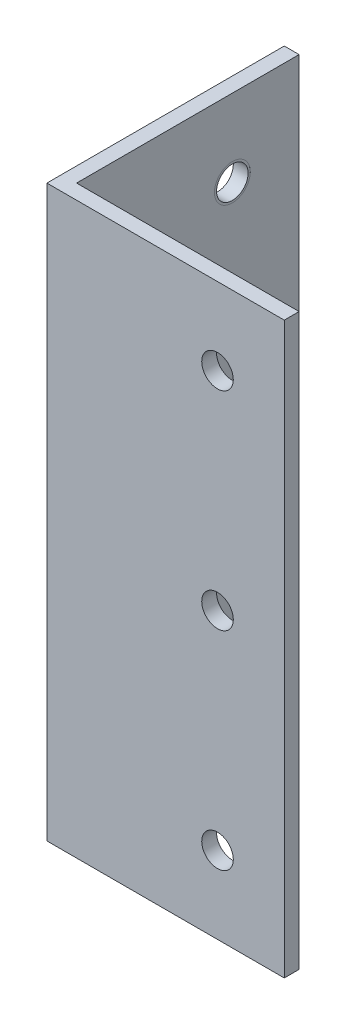
ISO-10303-21;
HEADER;
FILE_DESCRIPTION(('STEP AP214'),'2;1');
FILE_NAME('part.step','',(''),(''),'','','');
FILE_SCHEMA(('AUTOMOTIVE_DESIGN { 1 0 10303 214 1 1 1 1 }'));
ENDSEC;
DATA;
#1=APPLICATION_CONTEXT('core data for automotive mechanical design processes');
#2=APPLICATION_PROTOCOL_DEFINITION('international standard','automotive_design',2000,#1);
#3=PRODUCT_CONTEXT('',#1,'mechanical');
#4=PRODUCT('Part','Part','',(#3));
#5=PRODUCT_RELATED_PRODUCT_CATEGORY('part','',(#4));
#6=PRODUCT_DEFINITION_FORMATION('','',#4);
#7=PRODUCT_DEFINITION_CONTEXT('part definition',#1,'design');
#8=PRODUCT_DEFINITION('design','',#6,#7);
#9=PRODUCT_DEFINITION_SHAPE('','',#8);
#10=(LENGTH_UNIT() NAMED_UNIT(*) SI_UNIT(.MILLI.,.METRE.));
#11=(NAMED_UNIT(*) PLANE_ANGLE_UNIT() SI_UNIT($,.RADIAN.));
#12=(NAMED_UNIT(*) SI_UNIT($,.STERADIAN.) SOLID_ANGLE_UNIT());
#13=UNCERTAINTY_MEASURE_WITH_UNIT(LENGTH_MEASURE(1.E-05),#10,'distance_accuracy_value','');
#14=(GEOMETRIC_REPRESENTATION_CONTEXT(3) GLOBAL_UNCERTAINTY_ASSIGNED_CONTEXT((#13)) GLOBAL_UNIT_ASSIGNED_CONTEXT((#10,
#11,#12)) REPRESENTATION_CONTEXT('',''));
#15=CARTESIAN_POINT('',(0.,0.,0.));
#16=DIRECTION('',(0.,0.,1.));
#17=DIRECTION('',(1.,0.,0.));
#18=AXIS2_PLACEMENT_3D('',#15,#16,#17);
#19=CARTESIAN_POINT('',(-19.051,-34.925,-14.2875));
#20=DIRECTION('',(-1.,0.,0.));
#21=DIRECTION('',(0.,0.,1.));
#22=AXIS2_PLACEMENT_3D('',#19,#20,#21);
#23=PLANE('',#22);
#24=CARTESIAN_POINT('',(-19.051,-34.925,-14.2875));
#25=DIRECTION('',(1.,0.,0.));
#26=DIRECTION('',(0.,0.,-1.));
#27=AXIS2_PLACEMENT_3D('',#24,#25,#26);
#28=CIRCLE('',#27,3.8354);
#29=CARTESIAN_POINT('',(-19.051,-34.925,-18.1229));
#30=VERTEX_POINT('',#29);
#31=EDGE_CURVE('E150',#30,#30,#28,.T.);
#32=ORIENTED_EDGE('',*,*,#31,.T.);
#33=EDGE_LOOP('',(#32));
#34=FACE_BOUND('',#33,.T.);
#35=CARTESIAN_POINT('',(-19.051,-34.925,-14.2875));
#36=DIRECTION('',(1.,0.,0.));
#37=DIRECTION('',(0.,0.,-1.));
#38=AXIS2_PLACEMENT_3D('',#35,#36,#37);
#39=CIRCLE('',#38,3.3782);
#40=CARTESIAN_POINT('',(-19.051,-34.925,-17.6657));
#41=VERTEX_POINT('',#40);
#42=EDGE_CURVE('E465',#41,#41,#39,.T.);
#43=ORIENTED_EDGE('',*,*,#42,.F.);
#44=EDGE_LOOP('',(#43));
#45=FACE_BOUND('',#44,.T.);
#46=ADVANCED_FACE('F32',(#34,#45),#23,.F.);
#47=CARTESIAN_POINT('',(14.2875,9.52499999999999,19.051));
#48=DIRECTION('',(0.,0.,1.));
#49=DIRECTION('',(1.,0.,0.));
#50=AXIS2_PLACEMENT_3D('',#47,#48,#49);
#51=PLANE('',#50);
#52=CARTESIAN_POINT('',(14.2875,9.52499999999999,19.051));
#53=DIRECTION('',(0.,0.,-1.));
#54=DIRECTION('',(-1.,0.,0.));
#55=AXIS2_PLACEMENT_3D('',#52,#53,#54);
#56=CIRCLE('',#55,3.8354);
#57=CARTESIAN_POINT('',(10.4521,9.52499999999999,19.051));
#58=VERTEX_POINT('',#57);
#59=EDGE_CURVE('E135',#58,#58,#56,.T.);
#60=ORIENTED_EDGE('',*,*,#59,.T.);
#61=EDGE_LOOP('',(#60));
#62=FACE_BOUND('',#61,.T.);
#63=CARTESIAN_POINT('',(14.2875,9.52499999999999,19.051));
#64=DIRECTION('',(0.,0.,-1.));
#65=DIRECTION('',(-1.,0.,0.));
#66=AXIS2_PLACEMENT_3D('',#63,#64,#65);
#67=CIRCLE('',#66,3.3782);
#68=CARTESIAN_POINT('',(10.9093,9.52499999999999,19.051));
#69=VERTEX_POINT('',#68);
#70=EDGE_CURVE('E169',#69,#69,#67,.T.);
#71=ORIENTED_EDGE('',*,*,#70,.F.);
#72=EDGE_LOOP('',(#71));
#73=FACE_BOUND('',#72,.T.);
#74=ADVANCED_FACE('F219',(#62,#73),#51,.F.);
#75=CARTESIAN_POINT('',(165.1,-51.435,0.));
#76=DIRECTION('',(0.,-1.,0.));
#77=DIRECTION('',(1.,0.,0.));
#78=AXIS2_PLACEMENT_3D('',#75,#76,#77);
#79=PLANE('',#78);
#80=DIRECTION('',(0.,0.,-1.));
#81=VECTOR('',#80,1.);
#82=CARTESIAN_POINT('',(-19.05,-51.435,19.05));
#83=LINE('',#82,#81);
#84=CARTESIAN_POINT('',(-19.05,-51.435,19.05));
#85=VERTEX_POINT('',#84);
#86=CARTESIAN_POINT('',(-19.05,-51.435,-28.575));
#87=VERTEX_POINT('',#86);
#88=EDGE_CURVE('E42',#85,#87,#83,.T.);
#89=ORIENTED_EDGE('',*,*,#88,.F.);
#90=DIRECTION('',(-1.,0.,0.));
#91=VECTOR('',#90,1.);
#92=CARTESIAN_POINT('',(28.575,-51.435,19.05));
#93=LINE('',#92,#91);
#94=CARTESIAN_POINT('',(28.575,-51.435,19.05));
#95=VERTEX_POINT('',#94);
#96=EDGE_CURVE('E119',#95,#85,#93,.T.);
#97=ORIENTED_EDGE('',*,*,#96,.F.);
#98=DIRECTION('',(0.,0.,-1.));
#99=VECTOR('',#98,1.);
#100=CARTESIAN_POINT('',(28.575,-51.435,22.225));
#101=LINE('',#100,#99);
#102=CARTESIAN_POINT('',(28.575,-51.435,22.225));
#103=VERTEX_POINT('',#102);
#104=EDGE_CURVE('E123',#103,#95,#101,.T.);
#105=ORIENTED_EDGE('',*,*,#104,.F.);
#106=DIRECTION('',(1.,0.,0.));
#107=VECTOR('',#106,1.);
#108=CARTESIAN_POINT('',(-22.225,-51.435,22.225));
#109=LINE('',#108,#107);
#110=CARTESIAN_POINT('',(-22.225,-51.435,22.225));
#111=VERTEX_POINT('',#110);
#112=EDGE_CURVE('E72',#111,#103,#109,.T.);
#113=ORIENTED_EDGE('',*,*,#112,.F.);
#114=DIRECTION('',(0.,0.,1.));
#115=VECTOR('',#114,1.);
#116=CARTESIAN_POINT('',(-22.225,-51.435,-28.575));
#117=LINE('',#116,#115);
#118=CARTESIAN_POINT('',(-22.225,-51.435,-28.575));
#119=VERTEX_POINT('',#118);
#120=EDGE_CURVE('E77',#119,#111,#117,.T.);
#121=ORIENTED_EDGE('',*,*,#120,.F.);
#122=DIRECTION('',(-1.,0.,0.));
#123=VECTOR('',#122,1.);
#124=CARTESIAN_POINT('',(-19.05,-51.435,-28.575));
#125=LINE('',#124,#123);
#126=EDGE_CURVE('E98',#87,#119,#125,.T.);
#127=ORIENTED_EDGE('',*,*,#126,.F.);
#128=EDGE_LOOP('',(#89,#97,#105,#113,#121,#127));
#129=FACE_BOUND('',#128,.T.);
#130=ADVANCED_FACE('F34',(#129),#79,.T.);
#131=CARTESIAN_POINT('',(0.,70.485,0.));
#132=DIRECTION('',(0.,1.,0.));
#133=DIRECTION('',(0.,0.,1.));
#134=AXIS2_PLACEMENT_3D('',#131,#132,#133);
#135=PLANE('',#134);
#136=DIRECTION('',(0.,0.,-1.));
#137=VECTOR('',#136,1.);
#138=CARTESIAN_POINT('',(-19.05,70.485,19.05));
#139=LINE('',#138,#137);
#140=CARTESIAN_POINT('',(-19.05,70.485,19.05));
#141=VERTEX_POINT('',#140);
#142=CARTESIAN_POINT('',(-19.05,70.485,-28.575));
#143=VERTEX_POINT('',#142);
#144=EDGE_CURVE('E109',#141,#143,#139,.T.);
#145=ORIENTED_EDGE('',*,*,#144,.T.);
#146=DIRECTION('',(-1.,0.,0.));
#147=VECTOR('',#146,1.);
#148=CARTESIAN_POINT('',(-19.05,70.485,-28.575));
#149=LINE('',#148,#147);
#150=CARTESIAN_POINT('',(-22.225,70.485,-28.575));
#151=VERTEX_POINT('',#150);
#152=EDGE_CURVE('E96',#143,#151,#149,.T.);
#153=ORIENTED_EDGE('',*,*,#152,.T.);
#154=DIRECTION('',(0.,0.,1.));
#155=VECTOR('',#154,1.);
#156=CARTESIAN_POINT('',(-22.225,70.485,-28.575));
#157=LINE('',#156,#155);
#158=CARTESIAN_POINT('',(-22.225,70.485,22.225));
#159=VERTEX_POINT('',#158);
#160=EDGE_CURVE('E101',#151,#159,#157,.T.);
#161=ORIENTED_EDGE('',*,*,#160,.T.);
#162=DIRECTION('',(1.,0.,0.));
#163=VECTOR('',#162,1.);
#164=CARTESIAN_POINT('',(-22.225,70.485,22.225));
#165=LINE('',#164,#163);
#166=CARTESIAN_POINT('',(28.575,70.485,22.225));
#167=VERTEX_POINT('',#166);
#168=EDGE_CURVE('E105',#159,#167,#165,.T.);
#169=ORIENTED_EDGE('',*,*,#168,.T.);
#170=DIRECTION('',(0.,0.,-1.));
#171=VECTOR('',#170,1.);
#172=CARTESIAN_POINT('',(28.575,70.485,22.225));
#173=LINE('',#172,#171);
#174=CARTESIAN_POINT('',(28.575,70.485,19.05));
#175=VERTEX_POINT('',#174);
#176=EDGE_CURVE('E188',#167,#175,#173,.T.);
#177=ORIENTED_EDGE('',*,*,#176,.T.);
#178=DIRECTION('',(-1.,0.,0.));
#179=VECTOR('',#178,1.);
#180=CARTESIAN_POINT('',(28.575,70.485,19.05));
#181=LINE('',#180,#179);
#182=EDGE_CURVE('E116',#175,#141,#181,.T.);
#183=ORIENTED_EDGE('',*,*,#182,.T.);
#184=EDGE_LOOP('',(#145,#153,#161,#169,#177,#183));
#185=FACE_BOUND('',#184,.T.);
#186=ADVANCED_FACE('F107',(#185),#135,.T.);
#187=CARTESIAN_POINT('',(-19.05,-125.817048968553,-28.575));
#188=DIRECTION('',(0.,0.,-1.));
#189=DIRECTION('',(-1.,0.,0.));
#190=AXIS2_PLACEMENT_3D('',#187,#188,#189);
#191=PLANE('',#190);
#192=DIRECTION('',(0.,1.,0.));
#193=VECTOR('',#192,1.);
#194=CARTESIAN_POINT('',(-19.05,-125.817048968553,-28.575));
#195=LINE('',#194,#193);
#196=EDGE_CURVE('E11',#87,#143,#195,.T.);
#197=ORIENTED_EDGE('',*,*,#196,.F.);
#198=ORIENTED_EDGE('',*,*,#126,.T.);
#199=DIRECTION('',(0.,1.,0.));
#200=VECTOR('',#199,1.);
#201=CARTESIAN_POINT('',(-22.225,-125.817048968553,-28.575));
#202=LINE('',#201,#200);
#203=EDGE_CURVE('E93',#119,#151,#202,.T.);
#204=ORIENTED_EDGE('',*,*,#203,.T.);
#205=ORIENTED_EDGE('',*,*,#152,.F.);
#206=EDGE_LOOP('',(#197,#198,#204,#205));
#207=FACE_BOUND('',#206,.T.);
#208=ADVANCED_FACE('F94',(#207),#191,.T.);
#209=CARTESIAN_POINT('',(-22.225,-125.817048968553,-28.575));
#210=DIRECTION('',(-1.,0.,0.));
#211=DIRECTION('',(0.,0.,1.));
#212=AXIS2_PLACEMENT_3D('',#209,#210,#211);
#213=PLANE('',#212);
#214=CARTESIAN_POINT('',(-22.225,9.52499999999999,-14.2875));
#215=DIRECTION('',(-1.,0.,0.));
#216=DIRECTION('',(0.,0.,1.));
#217=AXIS2_PLACEMENT_3D('',#214,#215,#216);
#218=CIRCLE('',#217,3.3782);
#219=CARTESIAN_POINT('',(-22.225,9.52499999999999,-10.9093));
#220=VERTEX_POINT('',#219);
#221=EDGE_CURVE('E450',#220,#220,#218,.T.);
#222=ORIENTED_EDGE('',*,*,#221,.F.);
#223=EDGE_LOOP('',(#222));
#224=FACE_BOUND('',#223,.T.);
#225=CARTESIAN_POINT('',(-22.225,-34.925,-14.2875));
#226=DIRECTION('',(-1.,0.,0.));
#227=DIRECTION('',(0.,0.,1.));
#228=AXIS2_PLACEMENT_3D('',#225,#226,#227);
#229=CIRCLE('',#228,3.3782);
#230=CARTESIAN_POINT('',(-22.225,-34.925,-10.9093));
#231=VERTEX_POINT('',#230);
#232=EDGE_CURVE('E454',#231,#231,#229,.T.);
#233=ORIENTED_EDGE('',*,*,#232,.F.);
#234=EDGE_LOOP('',(#233));
#235=FACE_BOUND('',#234,.T.);
#236=CARTESIAN_POINT('',(-22.225,53.975,-14.2875));
#237=DIRECTION('',(-1.,0.,0.));
#238=DIRECTION('',(0.,0.,1.));
#239=AXIS2_PLACEMENT_3D('',#236,#237,#238);
#240=CIRCLE('',#239,3.3782);
#241=CARTESIAN_POINT('',(-22.225,53.975,-10.9093));
#242=VERTEX_POINT('',#241);
#243=EDGE_CURVE('E457',#242,#242,#240,.T.);
#244=ORIENTED_EDGE('',*,*,#243,.F.);
#245=EDGE_LOOP('',(#244));
#246=FACE_BOUND('',#245,.T.);
#247=ORIENTED_EDGE('',*,*,#203,.F.);
#248=ORIENTED_EDGE('',*,*,#120,.T.);
#249=DIRECTION('',(0.,1.,0.));
#250=VECTOR('',#249,1.);
#251=CARTESIAN_POINT('',(-22.225,-125.817048968553,22.225));
#252=LINE('',#251,#250);
#253=EDGE_CURVE('E88',#111,#159,#252,.T.);
#254=ORIENTED_EDGE('',*,*,#253,.T.);
#255=ORIENTED_EDGE('',*,*,#160,.F.);
#256=EDGE_LOOP('',(#247,#248,#254,#255));
#257=FACE_BOUND('',#256,.T.);
#258=ADVANCED_FACE('F102',(#224,#235,#246,#257),#213,.T.);
#259=CARTESIAN_POINT('',(-22.225,-125.817048968553,22.225));
#260=DIRECTION('',(0.,0.,1.));
#261=DIRECTION('',(1.,0.,0.));
#262=AXIS2_PLACEMENT_3D('',#259,#260,#261);
#263=PLANE('',#262);
#264=CARTESIAN_POINT('',(14.2875,53.975,22.225));
#265=DIRECTION('',(0.,0.,1.));
#266=DIRECTION('',(1.,0.,0.));
#267=AXIS2_PLACEMENT_3D('',#264,#265,#266);
#268=CIRCLE('',#267,3.3782);
#269=CARTESIAN_POINT('',(17.6657,53.975,22.225));
#270=VERTEX_POINT('',#269);
#271=EDGE_CURVE('E166',#270,#270,#268,.T.);
#272=ORIENTED_EDGE('',*,*,#271,.F.);
#273=EDGE_LOOP('',(#272));
#274=FACE_BOUND('',#273,.T.);
#275=CARTESIAN_POINT('',(14.2875,9.52499999999999,22.225));
#276=DIRECTION('',(0.,0.,1.));
#277=DIRECTION('',(1.,0.,0.));
#278=AXIS2_PLACEMENT_3D('',#275,#276,#277);
#279=CIRCLE('',#278,3.3782);
#280=CARTESIAN_POINT('',(17.6657,9.52499999999999,22.225));
#281=VERTEX_POINT('',#280);
#282=EDGE_CURVE('E172',#281,#281,#279,.T.);
#283=ORIENTED_EDGE('',*,*,#282,.F.);
#284=EDGE_LOOP('',(#283));
#285=FACE_BOUND('',#284,.T.);
#286=CARTESIAN_POINT('',(14.2875,-34.925,22.225));
#287=DIRECTION('',(0.,0.,1.));
#288=DIRECTION('',(1.,0.,0.));
#289=AXIS2_PLACEMENT_3D('',#286,#287,#288);
#290=CIRCLE('',#289,3.3782);
#291=CARTESIAN_POINT('',(17.6657,-34.925,22.225));
#292=VERTEX_POINT('',#291);
#293=EDGE_CURVE('E178',#292,#292,#290,.T.);
#294=ORIENTED_EDGE('',*,*,#293,.F.);
#295=EDGE_LOOP('',(#294));
#296=FACE_BOUND('',#295,.T.);
#297=ORIENTED_EDGE('',*,*,#253,.F.);
#298=ORIENTED_EDGE('',*,*,#112,.T.);
#299=DIRECTION('',(0.,1.,0.));
#300=VECTOR('',#299,1.);
#301=CARTESIAN_POINT('',(28.575,-125.817048968553,22.225));
#302=LINE('',#301,#300);
#303=EDGE_CURVE('E126',#103,#167,#302,.T.);
#304=ORIENTED_EDGE('',*,*,#303,.T.);
#305=ORIENTED_EDGE('',*,*,#168,.F.);
#306=EDGE_LOOP('',(#297,#298,#304,#305));
#307=FACE_BOUND('',#306,.T.);
#308=ADVANCED_FACE('F193',(#274,#285,#296,#307),#263,.T.);
#309=CARTESIAN_POINT('',(28.575,-125.817048968553,22.225));
#310=DIRECTION('',(1.,0.,0.));
#311=DIRECTION('',(0.,1.,0.));
#312=AXIS2_PLACEMENT_3D('',#309,#310,#311);
#313=PLANE('',#312);
#314=ORIENTED_EDGE('',*,*,#303,.F.);
#315=ORIENTED_EDGE('',*,*,#104,.T.);
#316=DIRECTION('',(0.,1.,0.));
#317=VECTOR('',#316,1.);
#318=CARTESIAN_POINT('',(28.575,-125.817048968553,19.05));
#319=LINE('',#318,#317);
#320=EDGE_CURVE('E122',#95,#175,#319,.T.);
#321=ORIENTED_EDGE('',*,*,#320,.T.);
#322=ORIENTED_EDGE('',*,*,#176,.F.);
#323=EDGE_LOOP('',(#314,#315,#321,#322));
#324=FACE_BOUND('',#323,.T.);
#325=ADVANCED_FACE('F196',(#324),#313,.T.);
#326=CARTESIAN_POINT('',(28.575,-125.817048968553,19.05));
#327=DIRECTION('',(0.,0.,-1.));
#328=DIRECTION('',(-1.,0.,0.));
#329=AXIS2_PLACEMENT_3D('',#326,#327,#328);
#330=PLANE('',#329);
#331=CARTESIAN_POINT('',(14.2875,53.975,19.05));
#332=DIRECTION('',(0.,0.,-1.));
#333=DIRECTION('',(-1.,0.,0.));
#334=AXIS2_PLACEMENT_3D('',#331,#332,#333);
#335=CIRCLE('',#334,3.8354);
#336=CARTESIAN_POINT('',(10.4521,53.975,19.05));
#337=VERTEX_POINT('',#336);
#338=EDGE_CURVE('E140',#337,#337,#335,.T.);
#339=ORIENTED_EDGE('',*,*,#338,.F.);
#340=EDGE_LOOP('',(#339));
#341=FACE_BOUND('',#340,.T.);
#342=CARTESIAN_POINT('',(14.2875,-34.925,19.05));
#343=DIRECTION('',(0.,0.,-1.));
#344=DIRECTION('',(-1.,0.,0.));
#345=AXIS2_PLACEMENT_3D('',#342,#343,#344);
#346=CIRCLE('',#345,3.8354);
#347=CARTESIAN_POINT('',(10.4521,-34.925,19.05));
#348=VERTEX_POINT('',#347);
#349=EDGE_CURVE('E136',#348,#348,#346,.T.);
#350=ORIENTED_EDGE('',*,*,#349,.F.);
#351=EDGE_LOOP('',(#350));
#352=FACE_BOUND('',#351,.T.);
#353=CARTESIAN_POINT('',(14.2875,9.52499999999999,19.05));
#354=DIRECTION('',(0.,0.,-1.));
#355=DIRECTION('',(-1.,0.,0.));
#356=AXIS2_PLACEMENT_3D('',#353,#354,#355);
#357=CIRCLE('',#356,3.8354);
#358=CARTESIAN_POINT('',(10.4521,9.52499999999999,19.05));
#359=VERTEX_POINT('',#358);
#360=EDGE_CURVE('E111',#359,#359,#357,.T.);
#361=ORIENTED_EDGE('',*,*,#360,.F.);
#362=EDGE_LOOP('',(#361));
#363=FACE_BOUND('',#362,.T.);
#364=ORIENTED_EDGE('',*,*,#320,.F.);
#365=ORIENTED_EDGE('',*,*,#96,.T.);
#366=DIRECTION('',(0.,1.,0.));
#367=VECTOR('',#366,1.);
#368=CARTESIAN_POINT('',(-19.05,-125.817048968553,19.05));
#369=LINE('',#368,#367);
#370=EDGE_CURVE('E118',#85,#141,#369,.T.);
#371=ORIENTED_EDGE('',*,*,#370,.T.);
#372=ORIENTED_EDGE('',*,*,#182,.F.);
#373=EDGE_LOOP('',(#364,#365,#371,#372));
#374=FACE_BOUND('',#373,.T.);
#375=ADVANCED_FACE('F199',(#341,#352,#363,#374),#330,.T.);
#376=CARTESIAN_POINT('',(-19.05,-125.817048968553,19.05));
#377=DIRECTION('',(1.,0.,0.));
#378=DIRECTION('',(0.,1.,0.));
#379=AXIS2_PLACEMENT_3D('',#376,#377,#378);
#380=PLANE('',#379);
#381=CARTESIAN_POINT('',(-19.05,53.975,-14.2875));
#382=DIRECTION('',(1.,0.,0.));
#383=DIRECTION('',(0.,1.,0.));
#384=AXIS2_PLACEMENT_3D('',#381,#382,#383);
#385=CIRCLE('',#384,3.8354);
#386=CARTESIAN_POINT('',(-19.05,57.8104,-14.2875));
#387=VERTEX_POINT('',#386);
#388=EDGE_CURVE('E36',#387,#387,#385,.T.);
#389=ORIENTED_EDGE('',*,*,#388,.F.);
#390=EDGE_LOOP('',(#389));
#391=FACE_BOUND('',#390,.T.);
#392=CARTESIAN_POINT('',(-19.05,-34.925,-14.2875));
#393=DIRECTION('',(1.,0.,0.));
#394=DIRECTION('',(0.,1.,0.));
#395=AXIS2_PLACEMENT_3D('',#392,#393,#394);
#396=CIRCLE('',#395,3.8354);
#397=CARTESIAN_POINT('',(-19.05,-31.0896,-14.2875));
#398=VERTEX_POINT('',#397);
#399=EDGE_CURVE('E148',#398,#398,#396,.T.);
#400=ORIENTED_EDGE('',*,*,#399,.F.);
#401=EDGE_LOOP('',(#400));
#402=FACE_BOUND('',#401,.T.);
#403=CARTESIAN_POINT('',(-19.05,9.52499999999999,-14.2875));
#404=DIRECTION('',(1.,0.,0.));
#405=DIRECTION('',(0.,1.,0.));
#406=AXIS2_PLACEMENT_3D('',#403,#404,#405);
#407=CIRCLE('',#406,3.8354);
#408=CARTESIAN_POINT('',(-19.05,13.3604,-14.2875));
#409=VERTEX_POINT('',#408);
#410=EDGE_CURVE('E144',#409,#409,#407,.T.);
#411=ORIENTED_EDGE('',*,*,#410,.F.);
#412=EDGE_LOOP('',(#411));
#413=FACE_BOUND('',#412,.T.);
#414=ORIENTED_EDGE('',*,*,#370,.F.);
#415=ORIENTED_EDGE('',*,*,#88,.T.);
#416=ORIENTED_EDGE('',*,*,#196,.T.);
#417=ORIENTED_EDGE('',*,*,#144,.F.);
#418=EDGE_LOOP('',(#414,#415,#416,#417));
#419=FACE_BOUND('',#418,.T.);
#420=ADVANCED_FACE('F201',(#391,#402,#413,#419),#380,.T.);
#421=CARTESIAN_POINT('',(14.2875,9.52499999999999,0.));
#422=DIRECTION('',(0.,0.,-1.));
#423=DIRECTION('',(-1.,0.,0.));
#424=AXIS2_PLACEMENT_3D('',#421,#422,#423);
#425=CYLINDRICAL_SURFACE('',#424,3.8354);
#426=ORIENTED_EDGE('',*,*,#360,.T.);
#427=EDGE_LOOP('',(#426));
#428=FACE_BOUND('',#427,.T.);
#429=ORIENTED_EDGE('',*,*,#59,.F.);
#430=EDGE_LOOP('',(#429));
#431=FACE_BOUND('',#430,.T.);
#432=ADVANCED_FACE('F203',(#428,#431),#425,.F.);
#433=CARTESIAN_POINT('',(14.2875,-34.925,19.051));
#434=DIRECTION('',(0.,0.,1.));
#435=DIRECTION('',(1.,0.,0.));
#436=AXIS2_PLACEMENT_3D('',#433,#434,#435);
#437=PLANE('',#436);
#438=CARTESIAN_POINT('',(14.2875,-34.925,19.051));
#439=DIRECTION('',(0.,0.,-1.));
#440=DIRECTION('',(-1.,0.,0.));
#441=AXIS2_PLACEMENT_3D('',#438,#439,#440);
#442=CIRCLE('',#441,3.3782);
#443=CARTESIAN_POINT('',(10.9093,-34.925,19.051));
#444=VERTEX_POINT('',#443);
#445=EDGE_CURVE('E175',#444,#444,#442,.T.);
#446=ORIENTED_EDGE('',*,*,#445,.F.);
#447=EDGE_LOOP('',(#446));
#448=FACE_BOUND('',#447,.T.);
#449=CARTESIAN_POINT('',(14.2875,-34.925,19.051));
#450=DIRECTION('',(0.,0.,-1.));
#451=DIRECTION('',(-1.,0.,0.));
#452=AXIS2_PLACEMENT_3D('',#449,#450,#451);
#453=CIRCLE('',#452,3.8354);
#454=CARTESIAN_POINT('',(10.4521,-34.925,19.051));
#455=VERTEX_POINT('',#454);
#456=EDGE_CURVE('E139',#455,#455,#453,.T.);
#457=ORIENTED_EDGE('',*,*,#456,.T.);
#458=EDGE_LOOP('',(#457));
#459=FACE_BOUND('',#458,.T.);
#460=ADVANCED_FACE('F210',(#448,#459),#437,.F.);
#461=CARTESIAN_POINT('',(14.2875,-34.925,0.));
#462=DIRECTION('',(0.,0.,-1.));
#463=DIRECTION('',(-1.,0.,0.));
#464=AXIS2_PLACEMENT_3D('',#461,#462,#463);
#465=CYLINDRICAL_SURFACE('',#464,3.8354);
#466=ORIENTED_EDGE('',*,*,#349,.T.);
#467=EDGE_LOOP('',(#466));
#468=FACE_BOUND('',#467,.T.);
#469=ORIENTED_EDGE('',*,*,#456,.F.);
#470=EDGE_LOOP('',(#469));
#471=FACE_BOUND('',#470,.T.);
#472=ADVANCED_FACE('F258',(#468,#471),#465,.F.);
#473=CARTESIAN_POINT('',(14.2875,53.975,19.051));
#474=DIRECTION('',(0.,0.,1.));
#475=DIRECTION('',(1.,0.,0.));
#476=AXIS2_PLACEMENT_3D('',#473,#474,#475);
#477=PLANE('',#476);
#478=CARTESIAN_POINT('',(14.2875,53.975,19.051));
#479=DIRECTION('',(0.,0.,-1.));
#480=DIRECTION('',(-1.,0.,0.));
#481=AXIS2_PLACEMENT_3D('',#478,#479,#480);
#482=CIRCLE('',#481,3.3782);
#483=CARTESIAN_POINT('',(10.9093,53.975,19.051));
#484=VERTEX_POINT('',#483);
#485=EDGE_CURVE('E146',#484,#484,#482,.T.);
#486=ORIENTED_EDGE('',*,*,#485,.F.);
#487=EDGE_LOOP('',(#486));
#488=FACE_BOUND('',#487,.T.);
#489=CARTESIAN_POINT('',(14.2875,53.975,19.051));
#490=DIRECTION('',(0.,0.,-1.));
#491=DIRECTION('',(-1.,0.,0.));
#492=AXIS2_PLACEMENT_3D('',#489,#490,#491);
#493=CIRCLE('',#492,3.8354);
#494=CARTESIAN_POINT('',(10.4521,53.975,19.051));
#495=VERTEX_POINT('',#494);
#496=EDGE_CURVE('E143',#495,#495,#493,.T.);
#497=ORIENTED_EDGE('',*,*,#496,.T.);
#498=EDGE_LOOP('',(#497));
#499=FACE_BOUND('',#498,.T.);
#500=ADVANCED_FACE('F254',(#488,#499),#477,.F.);
#501=CARTESIAN_POINT('',(14.2875,53.975,0.));
#502=DIRECTION('',(0.,0.,-1.));
#503=DIRECTION('',(-1.,0.,0.));
#504=AXIS2_PLACEMENT_3D('',#501,#502,#503);
#505=CYLINDRICAL_SURFACE('',#504,3.8354);
#506=ORIENTED_EDGE('',*,*,#338,.T.);
#507=EDGE_LOOP('',(#506));
#508=FACE_BOUND('',#507,.T.);
#509=ORIENTED_EDGE('',*,*,#496,.F.);
#510=EDGE_LOOP('',(#509));
#511=FACE_BOUND('',#510,.T.);
#512=ADVANCED_FACE('F250',(#508,#511),#505,.F.);
#513=CARTESIAN_POINT('',(14.2875,-34.925,19.051));
#514=DIRECTION('',(0.,0.,-1.));
#515=DIRECTION('',(-1.,0.,0.));
#516=AXIS2_PLACEMENT_3D('',#513,#514,#515);
#517=CYLINDRICAL_SURFACE('',#516,3.3782);
#518=ORIENTED_EDGE('',*,*,#445,.T.);
#519=EDGE_LOOP('',(#518));
#520=FACE_BOUND('',#519,.T.);
#521=ORIENTED_EDGE('',*,*,#293,.T.);
#522=EDGE_LOOP('',(#521));
#523=FACE_BOUND('',#522,.T.);
#524=ADVANCED_FACE('F246',(#520,#523),#517,.F.);
#525=CARTESIAN_POINT('',(14.2875,9.52499999999999,19.051));
#526=DIRECTION('',(0.,0.,-1.));
#527=DIRECTION('',(-1.,0.,0.));
#528=AXIS2_PLACEMENT_3D('',#525,#526,#527);
#529=CYLINDRICAL_SURFACE('',#528,3.3782);
#530=ORIENTED_EDGE('',*,*,#70,.T.);
#531=EDGE_LOOP('',(#530));
#532=FACE_BOUND('',#531,.T.);
#533=ORIENTED_EDGE('',*,*,#282,.T.);
#534=EDGE_LOOP('',(#533));
#535=FACE_BOUND('',#534,.T.);
#536=ADVANCED_FACE('F242',(#532,#535),#529,.F.);
#537=CARTESIAN_POINT('',(14.2875,53.975,19.051));
#538=DIRECTION('',(0.,0.,-1.));
#539=DIRECTION('',(-1.,0.,0.));
#540=AXIS2_PLACEMENT_3D('',#537,#538,#539);
#541=CYLINDRICAL_SURFACE('',#540,3.3782);
#542=ORIENTED_EDGE('',*,*,#485,.T.);
#543=EDGE_LOOP('',(#542));
#544=FACE_BOUND('',#543,.T.);
#545=ORIENTED_EDGE('',*,*,#271,.T.);
#546=EDGE_LOOP('',(#545));
#547=FACE_BOUND('',#546,.T.);
#548=ADVANCED_FACE('F238',(#544,#547),#541,.F.);
#549=CARTESIAN_POINT('',(-19.051,9.52499999999999,-14.2875));
#550=DIRECTION('',(-1.,0.,0.));
#551=DIRECTION('',(0.,0.,1.));
#552=AXIS2_PLACEMENT_3D('',#549,#550,#551);
#553=PLANE('',#552);
#554=CARTESIAN_POINT('',(-19.051,9.52499999999999,-14.2875));
#555=DIRECTION('',(1.,0.,0.));
#556=DIRECTION('',(0.,0.,-1.));
#557=AXIS2_PLACEMENT_3D('',#554,#555,#556);
#558=CIRCLE('',#557,3.3782);
#559=CARTESIAN_POINT('',(-19.051,9.52499999999999,-17.6657));
#560=VERTEX_POINT('',#559);
#561=EDGE_CURVE('E469',#560,#560,#558,.T.);
#562=ORIENTED_EDGE('',*,*,#561,.F.);
#563=EDGE_LOOP('',(#562));
#564=FACE_BOUND('',#563,.T.);
#565=CARTESIAN_POINT('',(-19.051,9.52499999999999,-14.2875));
#566=DIRECTION('',(1.,0.,0.));
#567=DIRECTION('',(0.,0.,-1.));
#568=AXIS2_PLACEMENT_3D('',#565,#566,#567);
#569=CIRCLE('',#568,3.8354);
#570=CARTESIAN_POINT('',(-19.051,9.52499999999999,-18.1229));
#571=VERTEX_POINT('',#570);
#572=EDGE_CURVE('E147',#571,#571,#569,.T.);
#573=ORIENTED_EDGE('',*,*,#572,.T.);
#574=EDGE_LOOP('',(#573));
#575=FACE_BOUND('',#574,.T.);
#576=ADVANCED_FACE('F234',(#564,#575),#553,.F.);
#577=CARTESIAN_POINT('',(0.,9.52499999999999,-14.2875));
#578=DIRECTION('',(1.,0.,0.));
#579=DIRECTION('',(0.,0.,-1.));
#580=AXIS2_PLACEMENT_3D('',#577,#578,#579);
#581=CYLINDRICAL_SURFACE('',#580,3.8354);
#582=ORIENTED_EDGE('',*,*,#410,.T.);
#583=EDGE_LOOP('',(#582));
#584=FACE_BOUND('',#583,.T.);
#585=ORIENTED_EDGE('',*,*,#572,.F.);
#586=EDGE_LOOP('',(#585));
#587=FACE_BOUND('',#586,.T.);
#588=ADVANCED_FACE('F231',(#584,#587),#581,.F.);
#589=CARTESIAN_POINT('',(0.,-34.925,-14.2875));
#590=DIRECTION('',(1.,0.,0.));
#591=DIRECTION('',(0.,0.,-1.));
#592=AXIS2_PLACEMENT_3D('',#589,#590,#591);
#593=CYLINDRICAL_SURFACE('',#592,3.8354);
#594=ORIENTED_EDGE('',*,*,#399,.T.);
#595=EDGE_LOOP('',(#594));
#596=FACE_BOUND('',#595,.T.);
#597=ORIENTED_EDGE('',*,*,#31,.F.);
#598=EDGE_LOOP('',(#597));
#599=FACE_BOUND('',#598,.T.);
#600=ADVANCED_FACE('F229',(#596,#599),#593,.F.);
#601=CARTESIAN_POINT('',(-19.051,53.975,-14.2875));
#602=DIRECTION('',(-1.,0.,0.));
#603=DIRECTION('',(0.,0.,1.));
#604=AXIS2_PLACEMENT_3D('',#601,#602,#603);
#605=PLANE('',#604);
#606=CARTESIAN_POINT('',(-19.051,53.975,-14.2875));
#607=DIRECTION('',(1.,0.,0.));
#608=DIRECTION('',(0.,0.,-1.));
#609=AXIS2_PLACEMENT_3D('',#606,#607,#608);
#610=CIRCLE('',#609,3.3782);
#611=CARTESIAN_POINT('',(-19.051,53.975,-17.6657));
#612=VERTEX_POINT('',#611);
#613=EDGE_CURVE('E459',#612,#612,#610,.T.);
#614=ORIENTED_EDGE('',*,*,#613,.F.);
#615=EDGE_LOOP('',(#614));
#616=FACE_BOUND('',#615,.T.);
#617=CARTESIAN_POINT('',(-19.051,53.975,-14.2875));
#618=DIRECTION('',(1.,0.,0.));
#619=DIRECTION('',(0.,0.,-1.));
#620=AXIS2_PLACEMENT_3D('',#617,#618,#619);
#621=CIRCLE('',#620,3.8354);
#622=CARTESIAN_POINT('',(-19.051,53.975,-18.1229));
#623=VERTEX_POINT('',#622);
#624=EDGE_CURVE('E160',#623,#623,#621,.T.);
#625=ORIENTED_EDGE('',*,*,#624,.T.);
#626=EDGE_LOOP('',(#625));
#627=FACE_BOUND('',#626,.T.);
#628=ADVANCED_FACE('F362',(#616,#627),#605,.F.);
#629=CARTESIAN_POINT('',(0.,53.975,-14.2875));
#630=DIRECTION('',(1.,0.,0.));
#631=DIRECTION('',(0.,0.,-1.));
#632=AXIS2_PLACEMENT_3D('',#629,#630,#631);
#633=CYLINDRICAL_SURFACE('',#632,3.8354);
#634=ORIENTED_EDGE('',*,*,#388,.T.);
#635=EDGE_LOOP('',(#634));
#636=FACE_BOUND('',#635,.T.);
#637=ORIENTED_EDGE('',*,*,#624,.F.);
#638=EDGE_LOOP('',(#637));
#639=FACE_BOUND('',#638,.T.);
#640=ADVANCED_FACE('F372',(#636,#639),#633,.F.);
#641=CARTESIAN_POINT('',(-19.051,53.975,-14.2875));
#642=DIRECTION('',(1.,0.,0.));
#643=DIRECTION('',(0.,0.,-1.));
#644=AXIS2_PLACEMENT_3D('',#641,#642,#643);
#645=CYLINDRICAL_SURFACE('',#644,3.3782);
#646=ORIENTED_EDGE('',*,*,#613,.T.);
#647=EDGE_LOOP('',(#646));
#648=FACE_BOUND('',#647,.T.);
#649=ORIENTED_EDGE('',*,*,#243,.T.);
#650=EDGE_LOOP('',(#649));
#651=FACE_BOUND('',#650,.T.);
#652=ADVANCED_FACE('F382',(#648,#651),#645,.F.);
#653=CARTESIAN_POINT('',(-19.051,-34.925,-14.2875));
#654=DIRECTION('',(1.,0.,0.));
#655=DIRECTION('',(0.,0.,-1.));
#656=AXIS2_PLACEMENT_3D('',#653,#654,#655);
#657=CYLINDRICAL_SURFACE('',#656,3.3782);
#658=ORIENTED_EDGE('',*,*,#42,.T.);
#659=EDGE_LOOP('',(#658));
#660=FACE_BOUND('',#659,.T.);
#661=ORIENTED_EDGE('',*,*,#232,.T.);
#662=EDGE_LOOP('',(#661));
#663=FACE_BOUND('',#662,.T.);
#664=ADVANCED_FACE('F391',(#660,#663),#657,.F.);
#665=CARTESIAN_POINT('',(-19.051,9.52499999999999,-14.2875));
#666=DIRECTION('',(1.,0.,0.));
#667=DIRECTION('',(0.,0.,-1.));
#668=AXIS2_PLACEMENT_3D('',#665,#666,#667);
#669=CYLINDRICAL_SURFACE('',#668,3.3782);
#670=ORIENTED_EDGE('',*,*,#561,.T.);
#671=EDGE_LOOP('',(#670));
#672=FACE_BOUND('',#671,.T.);
#673=ORIENTED_EDGE('',*,*,#221,.T.);
#674=EDGE_LOOP('',(#673));
#675=FACE_BOUND('',#674,.T.);
#676=ADVANCED_FACE('F401',(#672,#675),#669,.F.);
#677=CLOSED_SHELL('',(#46,#74,#130,#186,#208,#258,#308,#325,#375,#420,#432,#460,#472,#500,#512,
#524,#536,#548,#576,#588,#600,#628,#640,#652,#664,#676));
#678=MANIFOLD_SOLID_BREP('B2',#677);
#679=ADVANCED_BREP_SHAPE_REPRESENTATION('',(#18,#678),#14);
#680=SHAPE_DEFINITION_REPRESENTATION(#9,#679);
ENDSEC;
END-ISO-10303-21;
